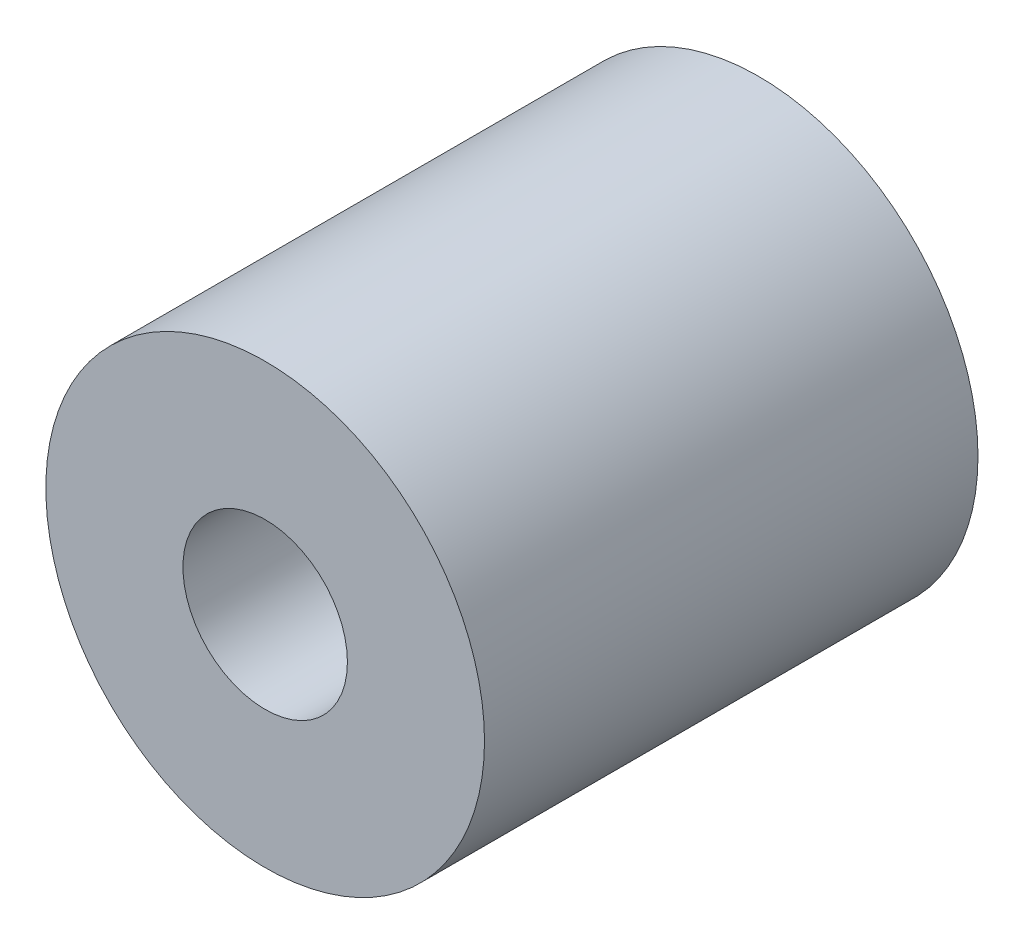
ISO-10303-21;
HEADER;
FILE_DESCRIPTION(('STEP AP214'),'2;1');
FILE_NAME('part.step','',(''),(''),'','','');
FILE_SCHEMA(('AUTOMOTIVE_DESIGN { 1 0 10303 214 1 1 1 1 }'));
ENDSEC;
DATA;
#1=APPLICATION_CONTEXT('core data for automotive mechanical design processes');
#2=APPLICATION_PROTOCOL_DEFINITION('international standard','automotive_design',2000,#1);
#3=PRODUCT_CONTEXT('',#1,'mechanical');
#4=PRODUCT('Part','Part','',(#3));
#5=PRODUCT_RELATED_PRODUCT_CATEGORY('part','',(#4));
#6=PRODUCT_DEFINITION_FORMATION('','',#4);
#7=PRODUCT_DEFINITION_CONTEXT('part definition',#1,'design');
#8=PRODUCT_DEFINITION('design','',#6,#7);
#9=PRODUCT_DEFINITION_SHAPE('','',#8);
#10=(LENGTH_UNIT() NAMED_UNIT(*) SI_UNIT(.MILLI.,.METRE.));
#11=(NAMED_UNIT(*) PLANE_ANGLE_UNIT() SI_UNIT($,.RADIAN.));
#12=(NAMED_UNIT(*) SI_UNIT($,.STERADIAN.) SOLID_ANGLE_UNIT());
#13=UNCERTAINTY_MEASURE_WITH_UNIT(LENGTH_MEASURE(1.E-05),#10,'distance_accuracy_value','');
#14=(GEOMETRIC_REPRESENTATION_CONTEXT(3) GLOBAL_UNCERTAINTY_ASSIGNED_CONTEXT((#13)) GLOBAL_UNIT_ASSIGNED_CONTEXT((#10,
#11,#12)) REPRESENTATION_CONTEXT('',''));
#15=CARTESIAN_POINT('',(0.,0.,0.));
#16=DIRECTION('',(0.,0.,1.));
#17=DIRECTION('',(1.,0.,0.));
#18=AXIS2_PLACEMENT_3D('',#15,#16,#17);
#19=CARTESIAN_POINT('',(0.,0.,90.));
#20=DIRECTION('',(0.,0.,1.));
#21=DIRECTION('',(1.,0.,0.));
#22=AXIS2_PLACEMENT_3D('',#19,#20,#21);
#23=PLANE('',#22);
#24=CARTESIAN_POINT('',(0.,0.,90.));
#25=DIRECTION('',(0.,0.,1.));
#26=DIRECTION('',(1.,0.,0.));
#27=AXIS2_PLACEMENT_3D('',#24,#25,#26);
#28=CIRCLE('',#27,40.);
#29=CARTESIAN_POINT('',(40.,0.,90.));
#30=VERTEX_POINT('',#29);
#31=EDGE_CURVE('E10',#30,#30,#28,.T.);
#32=ORIENTED_EDGE('',*,*,#31,.T.);
#33=EDGE_LOOP('',(#32));
#34=FACE_BOUND('',#33,.T.);
#35=CARTESIAN_POINT('',(0.,0.,90.));
#36=DIRECTION('',(0.,0.,1.));
#37=DIRECTION('',(1.,0.,0.));
#38=AXIS2_PLACEMENT_3D('',#35,#36,#37);
#39=CIRCLE('',#38,15.);
#40=CARTESIAN_POINT('',(15.,0.,90.));
#41=VERTEX_POINT('',#40);
#42=EDGE_CURVE('E54',#41,#41,#39,.T.);
#43=ORIENTED_EDGE('',*,*,#42,.F.);
#44=EDGE_LOOP('',(#43));
#45=FACE_BOUND('',#44,.T.);
#46=ADVANCED_FACE('F41',(#34,#45),#23,.T.);
#47=CARTESIAN_POINT('',(0.,0.,0.));
#48=DIRECTION('',(0.,0.,1.));
#49=DIRECTION('',(1.,0.,0.));
#50=AXIS2_PLACEMENT_3D('',#47,#48,#49);
#51=PLANE('',#50);
#52=CARTESIAN_POINT('',(0.,0.,0.));
#53=DIRECTION('',(0.,0.,1.));
#54=DIRECTION('',(1.,0.,0.));
#55=AXIS2_PLACEMENT_3D('',#52,#53,#54);
#56=CIRCLE('',#55,40.);
#57=CARTESIAN_POINT('',(40.,0.,0.));
#58=VERTEX_POINT('',#57);
#59=EDGE_CURVE('E45',#58,#58,#56,.T.);
#60=ORIENTED_EDGE('',*,*,#59,.F.);
#61=EDGE_LOOP('',(#60));
#62=FACE_BOUND('',#61,.T.);
#63=CARTESIAN_POINT('',(0.,0.,0.));
#64=DIRECTION('',(0.,0.,1.));
#65=DIRECTION('',(1.,0.,0.));
#66=AXIS2_PLACEMENT_3D('',#63,#64,#65);
#67=CIRCLE('',#66,15.);
#68=CARTESIAN_POINT('',(15.,0.,0.));
#69=VERTEX_POINT('',#68);
#70=EDGE_CURVE('E56',#69,#69,#67,.T.);
#71=ORIENTED_EDGE('',*,*,#70,.T.);
#72=EDGE_LOOP('',(#71));
#73=FACE_BOUND('',#72,.T.);
#74=ADVANCED_FACE('F68',(#62,#73),#51,.F.);
#75=CARTESIAN_POINT('',(0.,0.,90.));
#76=DIRECTION('',(0.,0.,-1.));
#77=DIRECTION('',(-1.,0.,0.));
#78=AXIS2_PLACEMENT_3D('',#75,#76,#77);
#79=CYLINDRICAL_SURFACE('',#78,40.);
#80=ORIENTED_EDGE('',*,*,#31,.F.);
#81=EDGE_LOOP('',(#80));
#82=FACE_BOUND('',#81,.T.);
#83=ORIENTED_EDGE('',*,*,#59,.T.);
#84=EDGE_LOOP('',(#83));
#85=FACE_BOUND('',#84,.T.);
#86=ADVANCED_FACE('F43',(#82,#85),#79,.T.);
#87=CARTESIAN_POINT('',(0.,0.,90.));
#88=DIRECTION('',(0.,0.,-1.));
#89=DIRECTION('',(-1.,0.,0.));
#90=AXIS2_PLACEMENT_3D('',#87,#88,#89);
#91=CYLINDRICAL_SURFACE('',#90,15.);
#92=ORIENTED_EDGE('',*,*,#42,.T.);
#93=EDGE_LOOP('',(#92));
#94=FACE_BOUND('',#93,.T.);
#95=ORIENTED_EDGE('',*,*,#70,.F.);
#96=EDGE_LOOP('',(#95));
#97=FACE_BOUND('',#96,.T.);
#98=ADVANCED_FACE('F64',(#94,#97),#91,.F.);
#99=CLOSED_SHELL('',(#46,#74,#86,#98));
#100=MANIFOLD_SOLID_BREP('B2',#99);
#101=ADVANCED_BREP_SHAPE_REPRESENTATION('',(#18,#100),#14);
#102=SHAPE_DEFINITION_REPRESENTATION(#9,#101);
ENDSEC;
END-ISO-10303-21;
